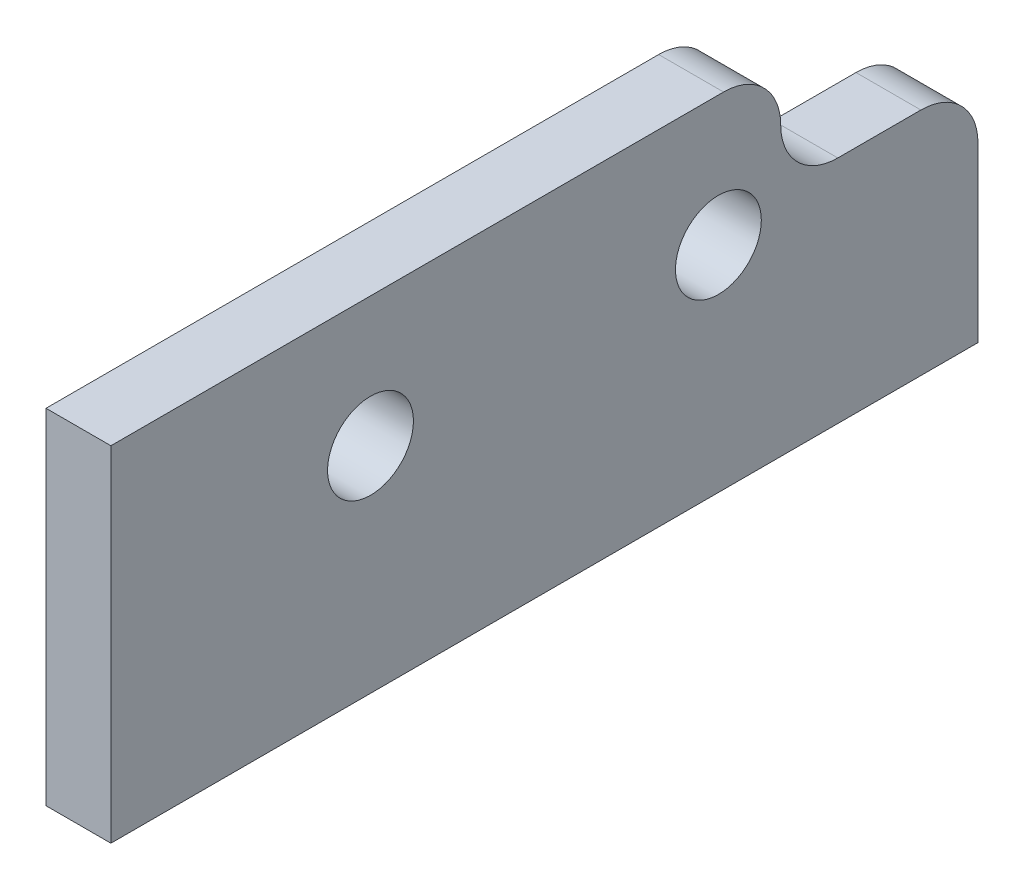
ISO-10303-21;
HEADER;
FILE_DESCRIPTION(('STEP AP214'),'2;1');
FILE_NAME('part.step','',(''),(''),'','','');
FILE_SCHEMA(('AUTOMOTIVE_DESIGN { 1 0 10303 214 1 1 1 1 }'));
ENDSEC;
DATA;
#1=APPLICATION_CONTEXT('core data for automotive mechanical design processes');
#2=APPLICATION_PROTOCOL_DEFINITION('international standard','automotive_design',2000,#1);
#3=PRODUCT_CONTEXT('',#1,'mechanical');
#4=PRODUCT('Part','Part','',(#3));
#5=PRODUCT_RELATED_PRODUCT_CATEGORY('part','',(#4));
#6=PRODUCT_DEFINITION_FORMATION('','',#4);
#7=PRODUCT_DEFINITION_CONTEXT('part definition',#1,'design');
#8=PRODUCT_DEFINITION('design','',#6,#7);
#9=PRODUCT_DEFINITION_SHAPE('','',#8);
#10=(LENGTH_UNIT() NAMED_UNIT(*) SI_UNIT(.MILLI.,.METRE.));
#11=(NAMED_UNIT(*) PLANE_ANGLE_UNIT() SI_UNIT($,.RADIAN.));
#12=(NAMED_UNIT(*) SI_UNIT($,.STERADIAN.) SOLID_ANGLE_UNIT());
#13=UNCERTAINTY_MEASURE_WITH_UNIT(LENGTH_MEASURE(1.E-05),#10,'distance_accuracy_value','');
#14=(GEOMETRIC_REPRESENTATION_CONTEXT(3) GLOBAL_UNCERTAINTY_ASSIGNED_CONTEXT((#13)) GLOBAL_UNIT_ASSIGNED_CONTEXT((#10,
#11,#12)) REPRESENTATION_CONTEXT('',''));
#15=CARTESIAN_POINT('',(0.,0.,0.));
#16=DIRECTION('',(0.,0.,1.));
#17=DIRECTION('',(1.,0.,0.));
#18=AXIS2_PLACEMENT_3D('',#15,#16,#17);
#19=CARTESIAN_POINT('',(3.175,-8.4201,-21.209));
#20=DIRECTION('',(0.,0.,1.));
#21=DIRECTION('',(1.,0.,0.));
#22=AXIS2_PLACEMENT_3D('',#19,#20,#21);
#23=PLANE('',#22);
#24=DIRECTION('',(0.,1.,0.));
#25=VECTOR('',#24,1.);
#26=CARTESIAN_POINT('',(0.,-8.4201,-21.209));
#27=LINE('',#26,#25);
#28=CARTESIAN_POINT('',(0.,-8.4201,-21.209));
#29=VERTEX_POINT('',#28);
#30=CARTESIAN_POINT('',(0.,0.038100000000001,-21.209));
#31=VERTEX_POINT('',#30);
#32=EDGE_CURVE('E133',#29,#31,#27,.T.);
#33=ORIENTED_EDGE('',*,*,#32,.T.);
#34=DIRECTION('',(1.,0.,0.));
#35=VECTOR('',#34,1.);
#36=CARTESIAN_POINT('',(3.175,0.038100000000001,-21.209));
#37=LINE('',#36,#35);
#38=CARTESIAN_POINT('',(3.175,0.038100000000001,-21.209));
#39=VERTEX_POINT('',#38);
#40=EDGE_CURVE('E121',#31,#39,#37,.T.);
#41=ORIENTED_EDGE('',*,*,#40,.T.);
#42=DIRECTION('',(0.,1.,0.));
#43=VECTOR('',#42,1.);
#44=CARTESIAN_POINT('',(3.175,-8.4201,-21.209));
#45=LINE('',#44,#43);
#46=CARTESIAN_POINT('',(3.175,-8.4201,-21.209));
#47=VERTEX_POINT('',#46);
#48=EDGE_CURVE('E113',#47,#39,#45,.T.);
#49=ORIENTED_EDGE('',*,*,#48,.F.);
#50=DIRECTION('',(-1.,0.,0.));
#51=VECTOR('',#50,1.);
#52=CARTESIAN_POINT('',(3.175,-8.4201,-21.209));
#53=LINE('',#52,#51);
#54=EDGE_CURVE('E129',#47,#29,#53,.T.);
#55=ORIENTED_EDGE('',*,*,#54,.T.);
#56=EDGE_LOOP('',(#33,#41,#49,#55));
#57=FACE_BOUND('',#56,.T.);
#58=ADVANCED_FACE('F39',(#57),#23,.F.);
#59=CARTESIAN_POINT('',(3.175,8.4201,21.209));
#60=DIRECTION('',(0.,-1.,0.));
#61=DIRECTION('',(0.,0.,-1.));
#62=AXIS2_PLACEMENT_3D('',#59,#60,#61);
#63=PLANE('',#62);
#64=DIRECTION('',(0.,0.,1.));
#65=VECTOR('',#64,1.);
#66=CARTESIAN_POINT('',(3.175,8.4201,21.209));
#67=LINE('',#66,#65);
#68=CARTESIAN_POINT('',(3.175,8.4201,-8.763));
#69=VERTEX_POINT('',#68);
#70=CARTESIAN_POINT('',(3.175,8.4201,21.209));
#71=VERTEX_POINT('',#70);
#72=EDGE_CURVE('E103',#69,#71,#67,.T.);
#73=ORIENTED_EDGE('',*,*,#72,.F.);
#74=DIRECTION('',(1.,0.,0.));
#75=VECTOR('',#74,1.);
#76=CARTESIAN_POINT('',(3.175,8.4201,-8.763));
#77=LINE('',#76,#75);
#78=CARTESIAN_POINT('',(0.,8.4201,-8.763));
#79=VERTEX_POINT('',#78);
#80=EDGE_CURVE('E157',#69,#79,#77,.F.);
#81=ORIENTED_EDGE('',*,*,#80,.T.);
#82=DIRECTION('',(0.,0.,1.));
#83=VECTOR('',#82,1.);
#84=CARTESIAN_POINT('',(0.,8.4201,21.209));
#85=LINE('',#84,#83);
#86=CARTESIAN_POINT('',(0.,8.4201,21.209));
#87=VERTEX_POINT('',#86);
#88=EDGE_CURVE('E118',#79,#87,#85,.T.);
#89=ORIENTED_EDGE('',*,*,#88,.T.);
#90=DIRECTION('',(-1.,0.,0.));
#91=VECTOR('',#90,1.);
#92=CARTESIAN_POINT('',(3.175,8.4201,21.209));
#93=LINE('',#92,#91);
#94=EDGE_CURVE('E116',#71,#87,#93,.T.);
#95=ORIENTED_EDGE('',*,*,#94,.F.);
#96=EDGE_LOOP('',(#73,#81,#89,#95));
#97=FACE_BOUND('',#96,.T.);
#98=ADVANCED_FACE('F117',(#97),#63,.F.);
#99=CARTESIAN_POINT('',(3.175,-8.4201,21.209));
#100=DIRECTION('',(0.,0.,-1.));
#101=DIRECTION('',(-1.,0.,0.));
#102=AXIS2_PLACEMENT_3D('',#99,#100,#101);
#103=PLANE('',#102);
#104=DIRECTION('',(0.,-1.,0.));
#105=VECTOR('',#104,1.);
#106=CARTESIAN_POINT('',(0.,-8.4201,21.209));
#107=LINE('',#106,#105);
#108=CARTESIAN_POINT('',(0.,-8.4201,21.209));
#109=VERTEX_POINT('',#108);
#110=EDGE_CURVE('E138',#87,#109,#107,.T.);
#111=ORIENTED_EDGE('',*,*,#110,.T.);
#112=DIRECTION('',(-1.,0.,0.));
#113=VECTOR('',#112,1.);
#114=CARTESIAN_POINT('',(3.175,-8.4201,21.209));
#115=LINE('',#114,#113);
#116=CARTESIAN_POINT('',(3.175,-8.4201,21.209));
#117=VERTEX_POINT('',#116);
#118=EDGE_CURVE('E122',#117,#109,#115,.T.);
#119=ORIENTED_EDGE('',*,*,#118,.F.);
#120=DIRECTION('',(0.,-1.,0.));
#121=VECTOR('',#120,1.);
#122=CARTESIAN_POINT('',(3.175,-8.4201,21.209));
#123=LINE('',#122,#121);
#124=EDGE_CURVE('E108',#71,#117,#123,.T.);
#125=ORIENTED_EDGE('',*,*,#124,.F.);
#126=ORIENTED_EDGE('',*,*,#94,.T.);
#127=EDGE_LOOP('',(#111,#119,#125,#126));
#128=FACE_BOUND('',#127,.T.);
#129=ADVANCED_FACE('F124',(#128),#103,.F.);
#130=CARTESIAN_POINT('',(3.175,-8.4201,21.209));
#131=DIRECTION('',(0.,1.,0.));
#132=DIRECTION('',(0.,0.,1.));
#133=AXIS2_PLACEMENT_3D('',#130,#131,#132);
#134=PLANE('',#133);
#135=DIRECTION('',(0.,0.,-1.));
#136=VECTOR('',#135,1.);
#137=CARTESIAN_POINT('',(0.,-8.4201,21.209));
#138=LINE('',#137,#136);
#139=EDGE_CURVE('E140',#109,#29,#138,.T.);
#140=ORIENTED_EDGE('',*,*,#139,.T.);
#141=ORIENTED_EDGE('',*,*,#54,.F.);
#142=DIRECTION('',(0.,0.,-1.));
#143=VECTOR('',#142,1.);
#144=CARTESIAN_POINT('',(3.175,-8.4201,21.209));
#145=LINE('',#144,#143);
#146=EDGE_CURVE('E127',#117,#47,#145,.T.);
#147=ORIENTED_EDGE('',*,*,#146,.F.);
#148=ORIENTED_EDGE('',*,*,#118,.T.);
#149=EDGE_LOOP('',(#140,#141,#147,#148));
#150=FACE_BOUND('',#149,.T.);
#151=ADVANCED_FACE('F173',(#150),#134,.F.);
#152=CARTESIAN_POINT('',(3.175,0.,0.));
#153=DIRECTION('',(-1.,0.,0.));
#154=DIRECTION('',(0.,0.,1.));
#155=AXIS2_PLACEMENT_3D('',#152,#153,#154);
#156=PLANE('',#155);
#157=CARTESIAN_POINT('',(3.175,2.0701,8.509));
#158=DIRECTION('',(1.,0.,0.));
#159=DIRECTION('',(0.,0.,-1.));
#160=AXIS2_PLACEMENT_3D('',#157,#158,#159);
#161=CIRCLE('',#160,2.1);
#162=CARTESIAN_POINT('',(3.175,2.0701,6.409));
#163=VERTEX_POINT('',#162);
#164=EDGE_CURVE('E185',#163,#163,#161,.T.);
#165=ORIENTED_EDGE('',*,*,#164,.F.);
#166=EDGE_LOOP('',(#165));
#167=FACE_BOUND('',#166,.T.);
#168=CARTESIAN_POINT('',(3.175,2.0701,-8.509));
#169=DIRECTION('',(1.,0.,0.));
#170=DIRECTION('',(0.,0.,-1.));
#171=AXIS2_PLACEMENT_3D('',#168,#169,#170);
#172=CIRCLE('',#171,2.1);
#173=CARTESIAN_POINT('',(3.175,2.0701,-10.609));
#174=VERTEX_POINT('',#173);
#175=EDGE_CURVE('E181',#174,#174,#172,.T.);
#176=ORIENTED_EDGE('',*,*,#175,.F.);
#177=EDGE_LOOP('',(#176));
#178=FACE_BOUND('',#177,.T.);
#179=ORIENTED_EDGE('',*,*,#48,.T.);
#180=CARTESIAN_POINT('',(3.175,0.038100000000001,-18.415));
#181=DIRECTION('',(-1.,0.,0.));
#182=DIRECTION('',(0.,0.,1.));
#183=AXIS2_PLACEMENT_3D('',#180,#181,#182);
#184=CIRCLE('',#183,2.794);
#185=CARTESIAN_POINT('',(3.175,2.8321,-18.415));
#186=VERTEX_POINT('',#185);
#187=EDGE_CURVE('E148',#39,#186,#184,.F.);
#188=ORIENTED_EDGE('',*,*,#187,.T.);
#189=DIRECTION('',(0.,0.,-1.));
#190=VECTOR('',#189,1.);
#191=CARTESIAN_POINT('',(3.175,2.8321,-21.209));
#192=LINE('',#191,#190);
#193=CARTESIAN_POINT('',(3.175,2.8321,-14.351));
#194=VERTEX_POINT('',#193);
#195=EDGE_CURVE('E163',#194,#186,#192,.T.);
#196=ORIENTED_EDGE('',*,*,#195,.F.);
#197=CARTESIAN_POINT('',(3.175,5.6261,-14.351));
#198=DIRECTION('',(-1.,0.,0.));
#199=DIRECTION('',(0.,0.,1.));
#200=AXIS2_PLACEMENT_3D('',#197,#198,#199);
#201=CIRCLE('',#200,2.794);
#202=CARTESIAN_POINT('',(3.175,5.6261,-11.557));
#203=VERTEX_POINT('',#202);
#204=EDGE_CURVE('E48',#194,#203,#201,.T.);
#205=ORIENTED_EDGE('',*,*,#204,.T.);
#206=CARTESIAN_POINT('',(3.175,5.6261,-8.763));
#207=DIRECTION('',(-1.,0.,0.));
#208=DIRECTION('',(0.,0.,1.));
#209=AXIS2_PLACEMENT_3D('',#206,#207,#208);
#210=CIRCLE('',#209,2.794);
#211=EDGE_CURVE('E111',#203,#69,#210,.F.);
#212=ORIENTED_EDGE('',*,*,#211,.T.);
#213=ORIENTED_EDGE('',*,*,#72,.T.);
#214=ORIENTED_EDGE('',*,*,#124,.T.);
#215=ORIENTED_EDGE('',*,*,#146,.T.);
#216=EDGE_LOOP('',(#179,#188,#196,#205,#212,#213,#214,#215));
#217=FACE_BOUND('',#216,.T.);
#218=ADVANCED_FACE('F106',(#167,#178,#217),#156,.F.);
#219=CARTESIAN_POINT('',(0.,0.,0.));
#220=DIRECTION('',(-1.,0.,0.));
#221=DIRECTION('',(0.,0.,1.));
#222=AXIS2_PLACEMENT_3D('',#219,#220,#221);
#223=PLANE('',#222);
#224=DIRECTION('',(0.,0.,-1.));
#225=VECTOR('',#224,1.);
#226=CARTESIAN_POINT('',(0.,2.8321,-21.209));
#227=LINE('',#226,#225);
#228=CARTESIAN_POINT('',(0.,2.8321,-14.351));
#229=VERTEX_POINT('',#228);
#230=CARTESIAN_POINT('',(0.,2.8321,-18.415));
#231=VERTEX_POINT('',#230);
#232=EDGE_CURVE('E182',#229,#231,#227,.T.);
#233=ORIENTED_EDGE('',*,*,#232,.T.);
#234=CARTESIAN_POINT('',(0.,0.038100000000001,-18.415));
#235=DIRECTION('',(-1.,0.,0.));
#236=DIRECTION('',(0.,0.,1.));
#237=AXIS2_PLACEMENT_3D('',#234,#235,#236);
#238=CIRCLE('',#237,2.794);
#239=EDGE_CURVE('E155',#231,#31,#238,.T.);
#240=ORIENTED_EDGE('',*,*,#239,.T.);
#241=ORIENTED_EDGE('',*,*,#32,.F.);
#242=ORIENTED_EDGE('',*,*,#139,.F.);
#243=ORIENTED_EDGE('',*,*,#110,.F.);
#244=ORIENTED_EDGE('',*,*,#88,.F.);
#245=CARTESIAN_POINT('',(0.,5.6261,-8.763));
#246=DIRECTION('',(-1.,0.,0.));
#247=DIRECTION('',(0.,0.,1.));
#248=AXIS2_PLACEMENT_3D('',#245,#246,#247);
#249=CIRCLE('',#248,2.794);
#250=CARTESIAN_POINT('',(0.,5.6261,-11.557));
#251=VERTEX_POINT('',#250);
#252=EDGE_CURVE('E54',#79,#251,#249,.T.);
#253=ORIENTED_EDGE('',*,*,#252,.T.);
#254=CARTESIAN_POINT('',(0.,5.6261,-14.351));
#255=DIRECTION('',(-1.,0.,0.));
#256=DIRECTION('',(0.,0.,1.));
#257=AXIS2_PLACEMENT_3D('',#254,#255,#256);
#258=CIRCLE('',#257,2.794);
#259=EDGE_CURVE('E11',#251,#229,#258,.F.);
#260=ORIENTED_EDGE('',*,*,#259,.T.);
#261=EDGE_LOOP('',(#233,#240,#241,#242,#243,#244,#253,#260));
#262=FACE_BOUND('',#261,.T.);
#263=CARTESIAN_POINT('',(0.,2.0701,8.509));
#264=DIRECTION('',(1.,0.,0.));
#265=DIRECTION('',(0.,0.,-1.));
#266=AXIS2_PLACEMENT_3D('',#263,#264,#265);
#267=CIRCLE('',#266,2.1);
#268=CARTESIAN_POINT('',(0.,2.0701,6.409));
#269=VERTEX_POINT('',#268);
#270=EDGE_CURVE('E136',#269,#269,#267,.T.);
#271=ORIENTED_EDGE('',*,*,#270,.T.);
#272=EDGE_LOOP('',(#271));
#273=FACE_BOUND('',#272,.T.);
#274=CARTESIAN_POINT('',(0.,2.0701,-8.509));
#275=DIRECTION('',(1.,0.,0.));
#276=DIRECTION('',(0.,0.,-1.));
#277=AXIS2_PLACEMENT_3D('',#274,#275,#276);
#278=CIRCLE('',#277,2.1);
#279=CARTESIAN_POINT('',(0.,2.0701,-10.609));
#280=VERTEX_POINT('',#279);
#281=EDGE_CURVE('E178',#280,#280,#278,.T.);
#282=ORIENTED_EDGE('',*,*,#281,.T.);
#283=EDGE_LOOP('',(#282));
#284=FACE_BOUND('',#283,.T.);
#285=ADVANCED_FACE('F168',(#262,#273,#284),#223,.T.);
#286=CARTESIAN_POINT('',(0.,2.0701,-8.509));
#287=DIRECTION('',(1.,0.,0.));
#288=DIRECTION('',(0.,0.,-1.));
#289=AXIS2_PLACEMENT_3D('',#286,#287,#288);
#290=CYLINDRICAL_SURFACE('',#289,2.1);
#291=ORIENTED_EDGE('',*,*,#281,.F.);
#292=EDGE_LOOP('',(#291));
#293=FACE_BOUND('',#292,.T.);
#294=ORIENTED_EDGE('',*,*,#175,.T.);
#295=EDGE_LOOP('',(#294));
#296=FACE_BOUND('',#295,.T.);
#297=ADVANCED_FACE('F236',(#293,#296),#290,.F.);
#298=CARTESIAN_POINT('',(0.,2.0701,8.509));
#299=DIRECTION('',(1.,0.,0.));
#300=DIRECTION('',(0.,0.,-1.));
#301=AXIS2_PLACEMENT_3D('',#298,#299,#300);
#302=CYLINDRICAL_SURFACE('',#301,2.1);
#303=ORIENTED_EDGE('',*,*,#270,.F.);
#304=EDGE_LOOP('',(#303));
#305=FACE_BOUND('',#304,.T.);
#306=ORIENTED_EDGE('',*,*,#164,.T.);
#307=EDGE_LOOP('',(#306));
#308=FACE_BOUND('',#307,.T.);
#309=ADVANCED_FACE('F227',(#305,#308),#302,.F.);
#310=CARTESIAN_POINT('',(0.,2.8321,-21.209));
#311=DIRECTION('',(0.,-1.,0.));
#312=DIRECTION('',(0.,0.,-1.));
#313=AXIS2_PLACEMENT_3D('',#310,#311,#312);
#314=PLANE('',#313);
#315=ORIENTED_EDGE('',*,*,#195,.T.);
#316=DIRECTION('',(1.,0.,0.));
#317=VECTOR('',#316,1.);
#318=CARTESIAN_POINT('',(0.,2.8321,-18.415));
#319=LINE('',#318,#317);
#320=EDGE_CURVE('E152',#186,#231,#319,.F.);
#321=ORIENTED_EDGE('',*,*,#320,.T.);
#322=ORIENTED_EDGE('',*,*,#232,.F.);
#323=DIRECTION('',(1.,0.,0.));
#324=VECTOR('',#323,1.);
#325=CARTESIAN_POINT('',(3.175,2.8321,-14.351));
#326=LINE('',#325,#324);
#327=EDGE_CURVE('E150',#229,#194,#326,.T.);
#328=ORIENTED_EDGE('',*,*,#327,.T.);
#329=EDGE_LOOP('',(#315,#321,#322,#328));
#330=FACE_BOUND('',#329,.T.);
#331=ADVANCED_FACE('F208',(#330),#314,.F.);
#332=CARTESIAN_POINT('',(3.175,0.038100000000001,-18.415));
#333=DIRECTION('',(1.,0.,0.));
#334=DIRECTION('',(0.,0.,-1.));
#335=AXIS2_PLACEMENT_3D('',#332,#333,#334);
#336=CYLINDRICAL_SURFACE('',#335,2.794);
#337=ORIENTED_EDGE('',*,*,#239,.F.);
#338=ORIENTED_EDGE('',*,*,#320,.F.);
#339=ORIENTED_EDGE('',*,*,#187,.F.);
#340=ORIENTED_EDGE('',*,*,#40,.F.);
#341=EDGE_LOOP('',(#337,#338,#339,#340));
#342=FACE_BOUND('',#341,.T.);
#343=ADVANCED_FACE('F197',(#342),#336,.T.);
#344=CARTESIAN_POINT('',(0.,5.6261,-14.351));
#345=DIRECTION('',(-1.,0.,0.));
#346=DIRECTION('',(0.,0.,1.));
#347=AXIS2_PLACEMENT_3D('',#344,#345,#346);
#348=CYLINDRICAL_SURFACE('',#347,2.794);
#349=ORIENTED_EDGE('',*,*,#327,.F.);
#350=ORIENTED_EDGE('',*,*,#259,.F.);
#351=DIRECTION('',(1.,0.,0.));
#352=VECTOR('',#351,1.);
#353=CARTESIAN_POINT('',(0.,5.6261,-11.557));
#354=LINE('',#353,#352);
#355=EDGE_CURVE('E43',#203,#251,#354,.F.);
#356=ORIENTED_EDGE('',*,*,#355,.F.);
#357=ORIENTED_EDGE('',*,*,#204,.F.);
#358=EDGE_LOOP('',(#349,#350,#356,#357));
#359=FACE_BOUND('',#358,.T.);
#360=ADVANCED_FACE('F41',(#359),#348,.F.);
#361=CARTESIAN_POINT('',(0.,5.6261,-8.763));
#362=DIRECTION('',(1.,0.,0.));
#363=DIRECTION('',(0.,0.,-1.));
#364=AXIS2_PLACEMENT_3D('',#361,#362,#363);
#365=CYLINDRICAL_SURFACE('',#364,2.794);
#366=ORIENTED_EDGE('',*,*,#252,.F.);
#367=ORIENTED_EDGE('',*,*,#80,.F.);
#368=ORIENTED_EDGE('',*,*,#211,.F.);
#369=ORIENTED_EDGE('',*,*,#355,.T.);
#370=EDGE_LOOP('',(#366,#367,#368,#369));
#371=FACE_BOUND('',#370,.T.);
#372=ADVANCED_FACE('F166',(#371),#365,.T.);
#373=CLOSED_SHELL('',(#58,#98,#129,#151,#218,#285,#297,#309,#331,#343,#360,#372));
#374=MANIFOLD_SOLID_BREP('B2',#373);
#375=ADVANCED_BREP_SHAPE_REPRESENTATION('',(#18,#374),#14);
#376=SHAPE_DEFINITION_REPRESENTATION(#9,#375);
ENDSEC;
END-ISO-10303-21;
